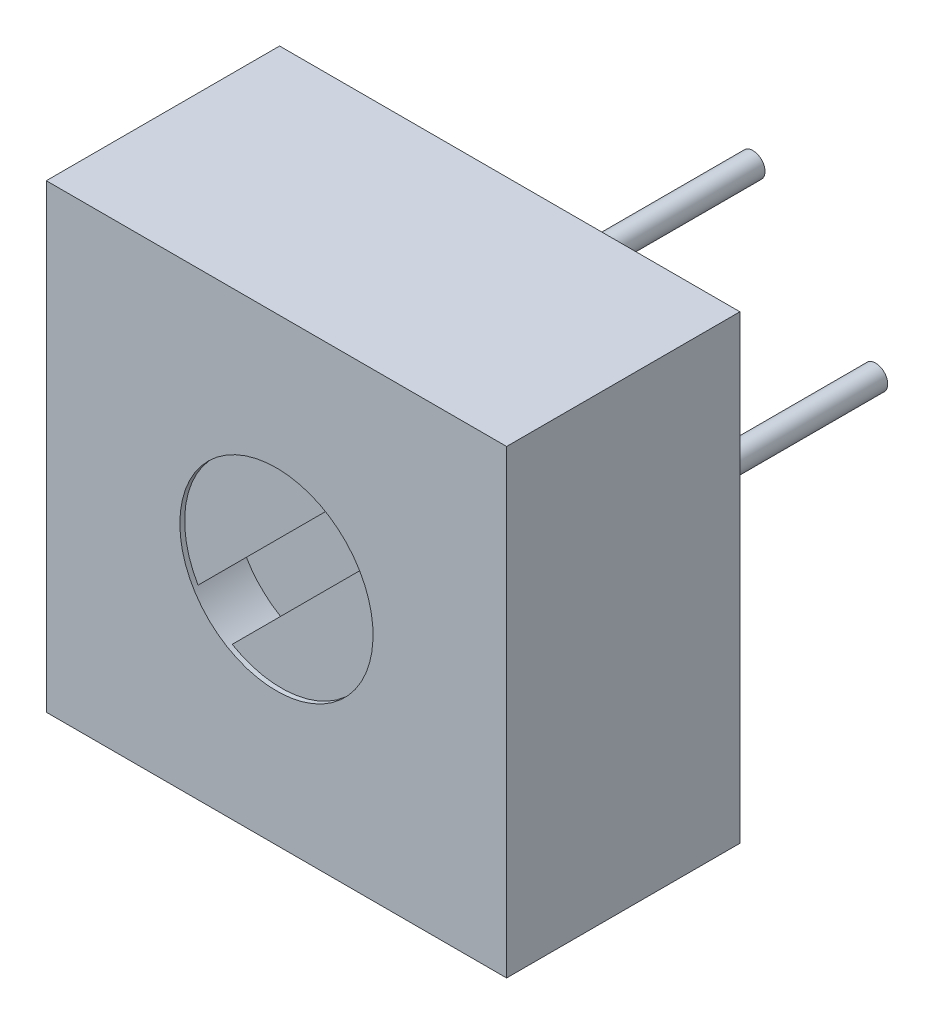
ISO-10303-21;
HEADER;
FILE_DESCRIPTION(('STEP AP214'),'2;1');
FILE_NAME('part.step','',(''),(''),'','','');
FILE_SCHEMA(('AUTOMOTIVE_DESIGN { 1 0 10303 214 1 1 1 1 }'));
ENDSEC;
DATA;
#1=APPLICATION_CONTEXT('core data for automotive mechanical design processes');
#2=APPLICATION_PROTOCOL_DEFINITION('international standard','automotive_design',2000,#1);
#3=PRODUCT_CONTEXT('',#1,'mechanical');
#4=PRODUCT('Part','Part','',(#3));
#5=PRODUCT_RELATED_PRODUCT_CATEGORY('part','',(#4));
#6=PRODUCT_DEFINITION_FORMATION('','',#4);
#7=PRODUCT_DEFINITION_CONTEXT('part definition',#1,'design');
#8=PRODUCT_DEFINITION('design','',#6,#7);
#9=PRODUCT_DEFINITION_SHAPE('','',#8);
#10=(LENGTH_UNIT() NAMED_UNIT(*) SI_UNIT(.MILLI.,.METRE.));
#11=(NAMED_UNIT(*) PLANE_ANGLE_UNIT() SI_UNIT($,.RADIAN.));
#12=(NAMED_UNIT(*) SI_UNIT($,.STERADIAN.) SOLID_ANGLE_UNIT());
#13=UNCERTAINTY_MEASURE_WITH_UNIT(LENGTH_MEASURE(1.E-05),#10,'distance_accuracy_value','');
#14=(GEOMETRIC_REPRESENTATION_CONTEXT(3) GLOBAL_UNCERTAINTY_ASSIGNED_CONTEXT((#13)) GLOBAL_UNIT_ASSIGNED_CONTEXT((#10,
#11,#12)) REPRESENTATION_CONTEXT('',''));
#15=CARTESIAN_POINT('',(0.,0.,0.));
#16=DIRECTION('',(0.,0.,1.));
#17=DIRECTION('',(1.,0.,0.));
#18=AXIS2_PLACEMENT_3D('',#15,#16,#17);
#19=CARTESIAN_POINT('',(4.765,-4.765,-0.1));
#20=DIRECTION('',(0.,0.,-1.));
#21=DIRECTION('',(-1.,0.,0.));
#22=AXIS2_PLACEMENT_3D('',#19,#20,#21);
#23=PLANE('',#22);
#24=DIRECTION('',(-0.707106781186544,-0.707106781186551,0.));
#25=VECTOR('',#24,1.);
#26=CARTESIAN_POINT('',(6.48785978435618,-3.74924699683034,-0.1));
#27=LINE('',#26,#25);
#28=CARTESIAN_POINT('',(6.48785978435618,-3.74924699683034,-0.1));
#29=VERTEX_POINT('',#28);
#30=CARTESIAN_POINT('',(3.74924699683036,-6.48785978435619,-0.1));
#31=VERTEX_POINT('',#30);
#32=EDGE_CURVE('E134',#29,#31,#27,.T.);
#33=ORIENTED_EDGE('',*,*,#32,.T.);
#34=CARTESIAN_POINT('',(4.765,-4.765,-0.1));
#35=DIRECTION('',(0.,0.,-1.));
#36=DIRECTION('',(-1.,0.,0.));
#37=AXIS2_PLACEMENT_3D('',#34,#35,#36);
#38=CIRCLE('',#37,2.);
#39=EDGE_CURVE('E126',#29,#31,#38,.T.);
#40=ORIENTED_EDGE('',*,*,#39,.F.);
#41=EDGE_LOOP('',(#33,#40));
#42=FACE_BOUND('',#41,.T.);
#43=ADVANCED_FACE('F34',(#42),#23,.F.);
#44=CARTESIAN_POINT('',(0.,0.,0.));
#45=DIRECTION('',(0.,0.,1.));
#46=DIRECTION('',(1.,0.,0.));
#47=AXIS2_PLACEMENT_3D('',#44,#45,#46);
#48=PLANE('',#47);
#49=DIRECTION('',(0.,-1.,0.));
#50=VECTOR('',#49,1.);
#51=CARTESIAN_POINT('',(0.,0.,0.));
#52=LINE('',#51,#50);
#53=CARTESIAN_POINT('',(0.,0.,0.));
#54=VERTEX_POINT('',#53);
#55=CARTESIAN_POINT('',(0.,-9.53,0.));
#56=VERTEX_POINT('',#55);
#57=EDGE_CURVE('E166',#54,#56,#52,.T.);
#58=ORIENTED_EDGE('',*,*,#57,.T.);
#59=DIRECTION('',(-1.,0.,0.));
#60=VECTOR('',#59,1.);
#61=CARTESIAN_POINT('',(9.53,-9.53,0.));
#62=LINE('',#61,#60);
#63=CARTESIAN_POINT('',(9.53,-9.53,0.));
#64=VERTEX_POINT('',#63);
#65=EDGE_CURVE('E180',#64,#56,#62,.T.);
#66=ORIENTED_EDGE('',*,*,#65,.F.);
#67=DIRECTION('',(0.,1.,0.));
#68=VECTOR('',#67,1.);
#69=CARTESIAN_POINT('',(9.53,-9.53,0.));
#70=LINE('',#69,#68);
#71=CARTESIAN_POINT('',(9.52999999999999,0.,0.));
#72=VERTEX_POINT('',#71);
#73=EDGE_CURVE('E183',#64,#72,#70,.T.);
#74=ORIENTED_EDGE('',*,*,#73,.T.);
#75=DIRECTION('',(1.,0.,0.));
#76=VECTOR('',#75,1.);
#77=CARTESIAN_POINT('',(0.,0.,0.));
#78=LINE('',#77,#76);
#79=EDGE_CURVE('E171',#54,#72,#78,.T.);
#80=ORIENTED_EDGE('',*,*,#79,.F.);
#81=EDGE_LOOP('',(#58,#66,#74,#80));
#82=FACE_BOUND('',#81,.T.);
#83=CARTESIAN_POINT('',(4.765,-4.765,0.));
#84=DIRECTION('',(0.,0.,-1.));
#85=DIRECTION('',(-1.,0.,0.));
#86=AXIS2_PLACEMENT_3D('',#83,#84,#85);
#87=CIRCLE('',#86,2.);
#88=CARTESIAN_POINT('',(2.765,-4.765,0.));
#89=VERTEX_POINT('',#88);
#90=EDGE_CURVE('E142',#89,#89,#87,.T.);
#91=ORIENTED_EDGE('',*,*,#90,.T.);
#92=EDGE_LOOP('',(#91));
#93=FACE_BOUND('',#92,.T.);
#94=ADVANCED_FACE('F193',(#82,#93),#48,.T.);
#95=CARTESIAN_POINT('',(0.,0.,-4.83));
#96=DIRECTION('',(-1.,0.,0.));
#97=DIRECTION('',(0.,0.,1.));
#98=AXIS2_PLACEMENT_3D('',#95,#96,#97);
#99=PLANE('',#98);
#100=ORIENTED_EDGE('',*,*,#57,.F.);
#101=DIRECTION('',(0.,0.,1.));
#102=VECTOR('',#101,1.);
#103=CARTESIAN_POINT('',(0.,0.,-4.83));
#104=LINE('',#103,#102);
#105=CARTESIAN_POINT('',(0.,0.,-4.83));
#106=VERTEX_POINT('',#105);
#107=EDGE_CURVE('E12',#106,#54,#104,.T.);
#108=ORIENTED_EDGE('',*,*,#107,.F.);
#109=DIRECTION('',(0.,-1.,0.));
#110=VECTOR('',#109,1.);
#111=CARTESIAN_POINT('',(0.,0.,-4.83));
#112=LINE('',#111,#110);
#113=CARTESIAN_POINT('',(0.,-9.53,-4.83));
#114=VERTEX_POINT('',#113);
#115=EDGE_CURVE('E169',#106,#114,#112,.T.);
#116=ORIENTED_EDGE('',*,*,#115,.T.);
#117=DIRECTION('',(0.,0.,1.));
#118=VECTOR('',#117,1.);
#119=CARTESIAN_POINT('',(0.,-9.53,-4.83));
#120=LINE('',#119,#118);
#121=EDGE_CURVE('E38',#114,#56,#120,.T.);
#122=ORIENTED_EDGE('',*,*,#121,.T.);
#123=EDGE_LOOP('',(#100,#108,#116,#122));
#124=FACE_BOUND('',#123,.T.);
#125=ADVANCED_FACE('F36',(#124),#99,.T.);
#126=CARTESIAN_POINT('',(0.,0.,-4.83));
#127=DIRECTION('',(0.,-1.,0.));
#128=DIRECTION('',(0.,0.,-1.));
#129=AXIS2_PLACEMENT_3D('',#126,#127,#128);
#130=PLANE('',#129);
#131=ORIENTED_EDGE('',*,*,#79,.T.);
#132=DIRECTION('',(0.,0.,1.));
#133=VECTOR('',#132,1.);
#134=CARTESIAN_POINT('',(9.52999999999999,0.,-4.83));
#135=LINE('',#134,#133);
#136=CARTESIAN_POINT('',(9.52999999999999,0.,-4.83));
#137=VERTEX_POINT('',#136);
#138=EDGE_CURVE('E43',#137,#72,#135,.T.);
#139=ORIENTED_EDGE('',*,*,#138,.F.);
#140=DIRECTION('',(1.,0.,0.));
#141=VECTOR('',#140,1.);
#142=CARTESIAN_POINT('',(0.,0.,-4.83));
#143=LINE('',#142,#141);
#144=EDGE_CURVE('E176',#106,#137,#143,.T.);
#145=ORIENTED_EDGE('',*,*,#144,.F.);
#146=ORIENTED_EDGE('',*,*,#107,.T.);
#147=EDGE_LOOP('',(#131,#139,#145,#146));
#148=FACE_BOUND('',#147,.T.);
#149=ADVANCED_FACE('F196',(#148),#130,.F.);
#150=CARTESIAN_POINT('',(9.53,-9.53,-4.83));
#151=DIRECTION('',(1.,0.,0.));
#152=DIRECTION('',(0.,1.,0.));
#153=AXIS2_PLACEMENT_3D('',#150,#151,#152);
#154=PLANE('',#153);
#155=ORIENTED_EDGE('',*,*,#73,.F.);
#156=DIRECTION('',(0.,0.,1.));
#157=VECTOR('',#156,1.);
#158=CARTESIAN_POINT('',(9.53,-9.53,-4.83));
#159=LINE('',#158,#157);
#160=CARTESIAN_POINT('',(9.53,-9.53,-4.83));
#161=VERTEX_POINT('',#160);
#162=EDGE_CURVE('E187',#161,#64,#159,.T.);
#163=ORIENTED_EDGE('',*,*,#162,.F.);
#164=DIRECTION('',(0.,1.,0.));
#165=VECTOR('',#164,1.);
#166=CARTESIAN_POINT('',(9.53,-9.53,-4.83));
#167=LINE('',#166,#165);
#168=EDGE_CURVE('E173',#161,#137,#167,.T.);
#169=ORIENTED_EDGE('',*,*,#168,.T.);
#170=ORIENTED_EDGE('',*,*,#138,.T.);
#171=EDGE_LOOP('',(#155,#163,#169,#170));
#172=FACE_BOUND('',#171,.T.);
#173=ADVANCED_FACE('F198',(#172),#154,.T.);
#174=CARTESIAN_POINT('',(9.53,-9.53,-4.83));
#175=DIRECTION('',(0.,1.,0.));
#176=DIRECTION('',(-1.,0.,0.));
#177=AXIS2_PLACEMENT_3D('',#174,#175,#176);
#178=PLANE('',#177);
#179=ORIENTED_EDGE('',*,*,#65,.T.);
#180=ORIENTED_EDGE('',*,*,#121,.F.);
#181=DIRECTION('',(-1.,0.,0.));
#182=VECTOR('',#181,1.);
#183=CARTESIAN_POINT('',(9.53,-9.53,-4.83));
#184=LINE('',#183,#182);
#185=EDGE_CURVE('E85',#161,#114,#184,.T.);
#186=ORIENTED_EDGE('',*,*,#185,.F.);
#187=ORIENTED_EDGE('',*,*,#162,.T.);
#188=EDGE_LOOP('',(#179,#180,#186,#187));
#189=FACE_BOUND('',#188,.T.);
#190=ADVANCED_FACE('F190',(#189),#178,.F.);
#191=CARTESIAN_POINT('',(0.,0.,-4.83));
#192=DIRECTION('',(0.,0.,1.));
#193=DIRECTION('',(1.,0.,0.));
#194=AXIS2_PLACEMENT_3D('',#191,#192,#193);
#195=PLANE('',#194);
#196=CARTESIAN_POINT('',(7.34,-4.765,-4.83));
#197=DIRECTION('',(0.,0.,1.));
#198=DIRECTION('',(1.,0.,0.));
#199=AXIS2_PLACEMENT_3D('',#196,#197,#198);
#200=CIRCLE('',#199,0.25);
#201=CARTESIAN_POINT('',(7.59,-4.765,-4.83));
#202=VERTEX_POINT('',#201);
#203=EDGE_CURVE('E154',#202,#202,#200,.T.);
#204=ORIENTED_EDGE('',*,*,#203,.T.);
#205=EDGE_LOOP('',(#204));
#206=FACE_BOUND('',#205,.T.);
#207=CARTESIAN_POINT('',(4.8,-2.225,-4.83));
#208=DIRECTION('',(0.,0.,1.));
#209=DIRECTION('',(1.,0.,0.));
#210=AXIS2_PLACEMENT_3D('',#207,#208,#209);
#211=CIRCLE('',#210,0.25);
#212=CARTESIAN_POINT('',(5.05,-2.225,-4.83));
#213=VERTEX_POINT('',#212);
#214=EDGE_CURVE('E153',#213,#213,#211,.T.);
#215=ORIENTED_EDGE('',*,*,#214,.T.);
#216=EDGE_LOOP('',(#215));
#217=FACE_BOUND('',#216,.T.);
#218=CARTESIAN_POINT('',(4.8,-7.305,-4.83));
#219=DIRECTION('',(0.,0.,1.));
#220=DIRECTION('',(1.,0.,0.));
#221=AXIS2_PLACEMENT_3D('',#218,#219,#220);
#222=CIRCLE('',#221,0.25);
#223=CARTESIAN_POINT('',(5.05,-7.305,-4.83));
#224=VERTEX_POINT('',#223);
#225=EDGE_CURVE('E160',#224,#224,#222,.T.);
#226=ORIENTED_EDGE('',*,*,#225,.T.);
#227=EDGE_LOOP('',(#226));
#228=FACE_BOUND('',#227,.T.);
#229=ORIENTED_EDGE('',*,*,#115,.F.);
#230=ORIENTED_EDGE('',*,*,#144,.T.);
#231=ORIENTED_EDGE('',*,*,#168,.F.);
#232=ORIENTED_EDGE('',*,*,#185,.T.);
#233=EDGE_LOOP('',(#229,#230,#231,#232));
#234=FACE_BOUND('',#233,.T.);
#235=ADVANCED_FACE('F199',(#206,#217,#228,#234),#195,.F.);
#236=CARTESIAN_POINT('',(4.8,-7.305,-9.83));
#237=DIRECTION('',(0.,0.,1.));
#238=DIRECTION('',(1.,0.,0.));
#239=AXIS2_PLACEMENT_3D('',#236,#237,#238);
#240=CYLINDRICAL_SURFACE('',#239,0.25);
#241=CARTESIAN_POINT('',(4.8,-7.305,-9.83));
#242=DIRECTION('',(0.,0.,1.));
#243=DIRECTION('',(1.,0.,0.));
#244=AXIS2_PLACEMENT_3D('',#241,#242,#243);
#245=CIRCLE('',#244,0.25);
#246=CARTESIAN_POINT('',(5.05,-7.305,-9.83));
#247=VERTEX_POINT('',#246);
#248=EDGE_CURVE('E163',#247,#247,#245,.T.);
#249=ORIENTED_EDGE('',*,*,#248,.T.);
#250=EDGE_LOOP('',(#249));
#251=FACE_BOUND('',#250,.T.);
#252=ORIENTED_EDGE('',*,*,#225,.F.);
#253=EDGE_LOOP('',(#252));
#254=FACE_BOUND('',#253,.T.);
#255=ADVANCED_FACE('F201',(#251,#254),#240,.T.);
#256=CARTESIAN_POINT('',(4.8,-7.305,-9.83));
#257=DIRECTION('',(0.,0.,1.));
#258=DIRECTION('',(1.,0.,0.));
#259=AXIS2_PLACEMENT_3D('',#256,#257,#258);
#260=PLANE('',#259);
#261=ORIENTED_EDGE('',*,*,#248,.F.);
#262=EDGE_LOOP('',(#261));
#263=FACE_BOUND('',#262,.T.);
#264=ADVANCED_FACE('F208',(#263),#260,.F.);
#265=CARTESIAN_POINT('',(4.8,-2.225,-9.83));
#266=DIRECTION('',(0.,0.,1.));
#267=DIRECTION('',(1.,0.,0.));
#268=AXIS2_PLACEMENT_3D('',#265,#266,#267);
#269=CYLINDRICAL_SURFACE('',#268,0.25);
#270=CARTESIAN_POINT('',(4.8,-2.225,-9.83));
#271=DIRECTION('',(0.,0.,1.));
#272=DIRECTION('',(1.,0.,0.));
#273=AXIS2_PLACEMENT_3D('',#270,#271,#272);
#274=CIRCLE('',#273,0.25);
#275=CARTESIAN_POINT('',(5.05,-2.225,-9.83));
#276=VERTEX_POINT('',#275);
#277=EDGE_CURVE('E157',#276,#276,#274,.T.);
#278=ORIENTED_EDGE('',*,*,#277,.T.);
#279=EDGE_LOOP('',(#278));
#280=FACE_BOUND('',#279,.T.);
#281=ORIENTED_EDGE('',*,*,#214,.F.);
#282=EDGE_LOOP('',(#281));
#283=FACE_BOUND('',#282,.T.);
#284=ADVANCED_FACE('F247',(#280,#283),#269,.T.);
#285=CARTESIAN_POINT('',(4.8,-2.225,-9.83));
#286=DIRECTION('',(0.,0.,1.));
#287=DIRECTION('',(1.,0.,0.));
#288=AXIS2_PLACEMENT_3D('',#285,#286,#287);
#289=PLANE('',#288);
#290=ORIENTED_EDGE('',*,*,#277,.F.);
#291=EDGE_LOOP('',(#290));
#292=FACE_BOUND('',#291,.T.);
#293=ADVANCED_FACE('F243',(#292),#289,.F.);
#294=CARTESIAN_POINT('',(7.34,-4.765,-9.83));
#295=DIRECTION('',(0.,0.,1.));
#296=DIRECTION('',(1.,0.,0.));
#297=AXIS2_PLACEMENT_3D('',#294,#295,#296);
#298=CYLINDRICAL_SURFACE('',#297,0.25);
#299=CARTESIAN_POINT('',(7.34,-4.765,-9.83));
#300=DIRECTION('',(0.,0.,1.));
#301=DIRECTION('',(1.,0.,0.));
#302=AXIS2_PLACEMENT_3D('',#299,#300,#301);
#303=CIRCLE('',#302,0.25);
#304=CARTESIAN_POINT('',(7.59,-4.765,-9.83));
#305=VERTEX_POINT('',#304);
#306=EDGE_CURVE('E150',#305,#305,#303,.T.);
#307=ORIENTED_EDGE('',*,*,#306,.T.);
#308=EDGE_LOOP('',(#307));
#309=FACE_BOUND('',#308,.T.);
#310=ORIENTED_EDGE('',*,*,#203,.F.);
#311=EDGE_LOOP('',(#310));
#312=FACE_BOUND('',#311,.T.);
#313=ADVANCED_FACE('F237',(#309,#312),#298,.T.);
#314=CARTESIAN_POINT('',(7.34,-4.765,-9.83));
#315=DIRECTION('',(0.,0.,1.));
#316=DIRECTION('',(1.,0.,0.));
#317=AXIS2_PLACEMENT_3D('',#314,#315,#316);
#318=PLANE('',#317);
#319=ORIENTED_EDGE('',*,*,#306,.F.);
#320=EDGE_LOOP('',(#319));
#321=FACE_BOUND('',#320,.T.);
#322=ADVANCED_FACE('F231',(#321),#318,.F.);
#323=CARTESIAN_POINT('',(4.765,-4.765,-0.1));
#324=DIRECTION('',(0.,0.,1.));
#325=DIRECTION('',(1.,0.,0.));
#326=AXIS2_PLACEMENT_3D('',#323,#324,#325);
#327=CYLINDRICAL_SURFACE('',#326,2.);
#328=CARTESIAN_POINT('',(3.04214021564381,-5.78075300316965,-0.1));
#329=VERTEX_POINT('',#328);
#330=CARTESIAN_POINT('',(5.78075300316963,-3.0421402156438,-0.1));
#331=VERTEX_POINT('',#330);
#332=EDGE_CURVE('E146',#329,#331,#38,.T.);
#333=ORIENTED_EDGE('',*,*,#332,.T.);
#334=DIRECTION('',(0.,0.,1.));
#335=VECTOR('',#334,1.);
#336=CARTESIAN_POINT('',(5.78075300316963,-3.0421402156438,-1.1));
#337=LINE('',#336,#335);
#338=CARTESIAN_POINT('',(5.78075300316963,-3.0421402156438,-1.1));
#339=VERTEX_POINT('',#338);
#340=EDGE_CURVE('E143',#339,#331,#337,.T.);
#341=ORIENTED_EDGE('',*,*,#340,.F.);
#342=CARTESIAN_POINT('',(4.765,-4.765,-1.1));
#343=DIRECTION('',(0.,0.,1.));
#344=DIRECTION('',(0.,-1.,0.));
#345=AXIS2_PLACEMENT_3D('',#342,#343,#344);
#346=CIRCLE('',#345,2.);
#347=CARTESIAN_POINT('',(6.48785978435618,-3.74924699683034,-1.1));
#348=VERTEX_POINT('',#347);
#349=EDGE_CURVE('E115',#348,#339,#346,.T.);
#350=ORIENTED_EDGE('',*,*,#349,.F.);
#351=DIRECTION('',(0.,0.,1.));
#352=VECTOR('',#351,1.);
#353=CARTESIAN_POINT('',(6.48785978435618,-3.74924699683034,-1.1));
#354=LINE('',#353,#352);
#355=EDGE_CURVE('E110',#348,#29,#354,.T.);
#356=ORIENTED_EDGE('',*,*,#355,.T.);
#357=ORIENTED_EDGE('',*,*,#39,.T.);
#358=DIRECTION('',(0.,0.,1.));
#359=VECTOR('',#358,1.);
#360=CARTESIAN_POINT('',(3.74924699683036,-6.48785978435619,-1.1));
#361=LINE('',#360,#359);
#362=CARTESIAN_POINT('',(3.74924699683036,-6.48785978435619,-1.1));
#363=VERTEX_POINT('',#362);
#364=EDGE_CURVE('E51',#363,#31,#361,.T.);
#365=ORIENTED_EDGE('',*,*,#364,.F.);
#366=CARTESIAN_POINT('',(4.765,-4.765,-1.1));
#367=DIRECTION('',(0.,0.,1.));
#368=DIRECTION('',(0.,-1.,0.));
#369=AXIS2_PLACEMENT_3D('',#366,#367,#368);
#370=CIRCLE('',#369,2.);
#371=CARTESIAN_POINT('',(3.04214021564381,-5.78075300316965,-1.1));
#372=VERTEX_POINT('',#371);
#373=EDGE_CURVE('E116',#372,#363,#370,.T.);
#374=ORIENTED_EDGE('',*,*,#373,.F.);
#375=DIRECTION('',(0.,0.,1.));
#376=VECTOR('',#375,1.);
#377=CARTESIAN_POINT('',(3.04214021564381,-5.78075300316965,-1.1));
#378=LINE('',#377,#376);
#379=EDGE_CURVE('E140',#372,#329,#378,.T.);
#380=ORIENTED_EDGE('',*,*,#379,.T.);
#381=EDGE_LOOP('',(#333,#341,#350,#356,#357,#365,#374,#380));
#382=FACE_BOUND('',#381,.T.);
#383=ORIENTED_EDGE('',*,*,#90,.F.);
#384=EDGE_LOOP('',(#383));
#385=FACE_BOUND('',#384,.T.);
#386=ADVANCED_FACE('F122',(#382,#385),#327,.F.);
#387=ORIENTED_EDGE('',*,*,#332,.F.);
#388=DIRECTION('',(-0.707106781186544,-0.707106781186551,0.));
#389=VECTOR('',#388,1.);
#390=CARTESIAN_POINT('',(5.78075300316963,-3.0421402156438,-0.1));
#391=LINE('',#390,#389);
#392=EDGE_CURVE('E131',#331,#329,#391,.T.);
#393=ORIENTED_EDGE('',*,*,#392,.F.);
#394=EDGE_LOOP('',(#387,#393));
#395=FACE_BOUND('',#394,.T.);
#396=ADVANCED_FACE('F216',(#395),#23,.F.);
#397=CARTESIAN_POINT('',(5.78075300316963,-3.0421402156438,-1.1));
#398=DIRECTION('',(-0.707106781186551,0.707106781186544,0.));
#399=DIRECTION('',(-0.707106781186544,-0.707106781186551,0.));
#400=AXIS2_PLACEMENT_3D('',#397,#398,#399);
#401=PLANE('',#400);
#402=ORIENTED_EDGE('',*,*,#392,.T.);
#403=ORIENTED_EDGE('',*,*,#379,.F.);
#404=DIRECTION('',(-0.707106781186544,-0.707106781186551,0.));
#405=VECTOR('',#404,1.);
#406=CARTESIAN_POINT('',(5.78075300316963,-3.0421402156438,-1.1));
#407=LINE('',#406,#405);
#408=EDGE_CURVE('E127',#339,#372,#407,.T.);
#409=ORIENTED_EDGE('',*,*,#408,.F.);
#410=ORIENTED_EDGE('',*,*,#340,.T.);
#411=EDGE_LOOP('',(#402,#403,#409,#410));
#412=FACE_BOUND('',#411,.T.);
#413=ADVANCED_FACE('F223',(#412),#401,.F.);
#414=CARTESIAN_POINT('',(6.48785978435618,-3.74924699683034,-1.1));
#415=DIRECTION('',(-0.707106781186551,0.707106781186544,0.));
#416=DIRECTION('',(-0.707106781186544,-0.707106781186551,0.));
#417=AXIS2_PLACEMENT_3D('',#414,#415,#416);
#418=PLANE('',#417);
#419=ORIENTED_EDGE('',*,*,#32,.F.);
#420=ORIENTED_EDGE('',*,*,#355,.F.);
#421=DIRECTION('',(-0.707106781186544,-0.707106781186551,0.));
#422=VECTOR('',#421,1.);
#423=CARTESIAN_POINT('',(6.48785978435618,-3.74924699683034,-1.1));
#424=LINE('',#423,#422);
#425=EDGE_CURVE('E108',#348,#363,#424,.T.);
#426=ORIENTED_EDGE('',*,*,#425,.T.);
#427=ORIENTED_EDGE('',*,*,#364,.T.);
#428=EDGE_LOOP('',(#419,#420,#426,#427));
#429=FACE_BOUND('',#428,.T.);
#430=ADVANCED_FACE('F109',(#429),#418,.T.);
#431=CARTESIAN_POINT('',(4.765,-4.765,-1.1));
#432=DIRECTION('',(0.,0.,1.));
#433=DIRECTION('',(0.,-1.,0.));
#434=AXIS2_PLACEMENT_3D('',#431,#432,#433);
#435=PLANE('',#434);
#436=ORIENTED_EDGE('',*,*,#373,.T.);
#437=ORIENTED_EDGE('',*,*,#425,.F.);
#438=ORIENTED_EDGE('',*,*,#349,.T.);
#439=ORIENTED_EDGE('',*,*,#408,.T.);
#440=EDGE_LOOP('',(#436,#437,#438,#439));
#441=FACE_BOUND('',#440,.T.);
#442=ADVANCED_FACE('F129',(#441),#435,.T.);
#443=CLOSED_SHELL('',(#43,#94,#125,#149,#173,#190,#235,#255,#264,#284,#293,#313,#322,#386,#396,
#413,#430,#442));
#444=MANIFOLD_SOLID_BREP('B2',#443);
#445=ADVANCED_BREP_SHAPE_REPRESENTATION('',(#18,#444),#14);
#446=SHAPE_DEFINITION_REPRESENTATION(#9,#445);
ENDSEC;
END-ISO-10303-21;
